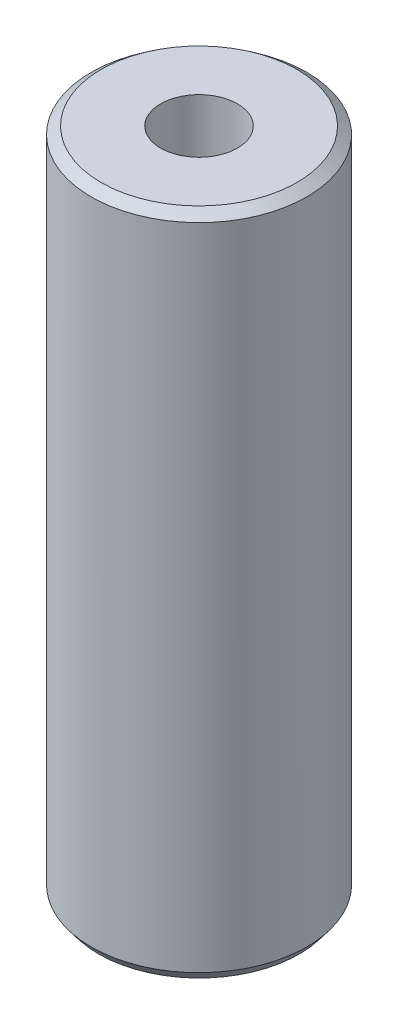
ISO-10303-21;
HEADER;
FILE_DESCRIPTION(('STEP AP214'),'2;1');
FILE_NAME('part.step','',(''),(''),'','','');
FILE_SCHEMA(('AUTOMOTIVE_DESIGN { 1 0 10303 214 1 1 1 1 }'));
ENDSEC;
DATA;
#1=APPLICATION_CONTEXT('core data for automotive mechanical design processes');
#2=APPLICATION_PROTOCOL_DEFINITION('international standard','automotive_design',2000,#1);
#3=PRODUCT_CONTEXT('',#1,'mechanical');
#4=PRODUCT('Part','Part','',(#3));
#5=PRODUCT_RELATED_PRODUCT_CATEGORY('part','',(#4));
#6=PRODUCT_DEFINITION_FORMATION('','',#4);
#7=PRODUCT_DEFINITION_CONTEXT('part definition',#1,'design');
#8=PRODUCT_DEFINITION('design','',#6,#7);
#9=PRODUCT_DEFINITION_SHAPE('','',#8);
#10=(LENGTH_UNIT() NAMED_UNIT(*) SI_UNIT(.MILLI.,.METRE.));
#11=(NAMED_UNIT(*) PLANE_ANGLE_UNIT() SI_UNIT($,.RADIAN.));
#12=(NAMED_UNIT(*) SI_UNIT($,.STERADIAN.) SOLID_ANGLE_UNIT());
#13=UNCERTAINTY_MEASURE_WITH_UNIT(LENGTH_MEASURE(1.E-05),#10,'distance_accuracy_value','');
#14=(GEOMETRIC_REPRESENTATION_CONTEXT(3) GLOBAL_UNCERTAINTY_ASSIGNED_CONTEXT((#13)) GLOBAL_UNIT_ASSIGNED_CONTEXT((#10,
#11,#12)) REPRESENTATION_CONTEXT('',''));
#15=CARTESIAN_POINT('',(0.,0.,0.));
#16=DIRECTION('',(0.,0.,1.));
#17=DIRECTION('',(1.,0.,0.));
#18=AXIS2_PLACEMENT_3D('',#15,#16,#17);
#19=CARTESIAN_POINT('',(0.,123.657801220755,0.));
#20=DIRECTION('',(0.,-1.,0.));
#21=DIRECTION('',(0.,0.,-1.));
#22=AXIS2_PLACEMENT_3D('',#19,#20,#21);
#23=CYLINDRICAL_SURFACE('',#22,20.);
#24=CARTESIAN_POINT('',(0.,122.269175722397,0.));
#25=DIRECTION('',(0.,1.,0.));
#26=DIRECTION('',(0.,0.,1.));
#27=AXIS2_PLACEMENT_3D('',#24,#25,#26);
#28=CIRCLE('',#27,20.);
#29=CARTESIAN_POINT('',(0.,122.269175722397,-20.));
#30=VERTEX_POINT('',#29);
#31=EDGE_CURVE('E50',#30,#30,#28,.F.);
#32=CARTESIAN_POINT('',(0.,1.83832751486898,0.));
#33=DIRECTION('',(0.,1.,0.));
#34=DIRECTION('',(0.,0.,1.));
#35=AXIS2_PLACEMENT_3D('',#32,#33,#34);
#36=CIRCLE('',#35,20.);
#37=CARTESIAN_POINT('',(0.,1.83832751486897,-20.));
#38=VERTEX_POINT('',#37);
#39=EDGE_CURVE('E51',#38,#38,#36,.T.);
#40=CARTESIAN_POINT('',(0.,122.269175722397,-20.));
#41=CARTESIAN_POINT('',(0.,121.014687720235,-20.));
#42=CARTESIAN_POINT('',(0.,119.760199718074,-20.));
#43=CARTESIAN_POINT('',(0.,117.25122371375,-20.));
#44=CARTESIAN_POINT('',(0.,115.996735711588,-20.));
#45=CARTESIAN_POINT('',(0.,113.487759707265,-20.));
#46=CARTESIAN_POINT('',(0.,112.233271705103,-20.));
#47=CARTESIAN_POINT('',(0.,109.72429570078,-20.));
#48=CARTESIAN_POINT('',(0.,108.469807698618,-20.));
#49=CARTESIAN_POINT('',(0.,105.960831694294,-20.));
#50=CARTESIAN_POINT('',(0.,104.706343692133,-20.));
#51=CARTESIAN_POINT('',(0.,102.197367687809,-20.));
#52=CARTESIAN_POINT('',(0.,100.942879685647,-20.));
#53=CARTESIAN_POINT('',(0.,98.4339036813239,-20.));
#54=CARTESIAN_POINT('',(0.,97.1794156791622,-20.));
#55=CARTESIAN_POINT('',(0.,94.6704396748387,-20.));
#56=CARTESIAN_POINT('',(0.,93.4159516726769,-20.));
#57=CARTESIAN_POINT('',(0.,90.9069756683534,-20.));
#58=CARTESIAN_POINT('',(0.,89.6524876661917,-20.));
#59=CARTESIAN_POINT('',(0.,87.1435116618682,-20.));
#60=CARTESIAN_POINT('',(0.,85.8890236597064,-20.));
#61=CARTESIAN_POINT('',(0.,83.3800476553829,-20.));
#62=CARTESIAN_POINT('',(0.,82.1255596532212,-20.));
#63=CARTESIAN_POINT('',(0.,79.6165836488976,-20.));
#64=CARTESIAN_POINT('',(0.,78.3620956467359,-20.));
#65=CARTESIAN_POINT('',(0.,75.8531196424124,-20.));
#66=CARTESIAN_POINT('',(0.,74.5986316402506,-20.));
#67=CARTESIAN_POINT('',(0.,72.0896556359271,-20.));
#68=CARTESIAN_POINT('',(0.,70.8351676337654,-20.));
#69=CARTESIAN_POINT('',(0.,68.3261916294419,-20.));
#70=CARTESIAN_POINT('',(0.,67.0717036272801,-20.));
#71=CARTESIAN_POINT('',(0.,64.5627276229566,-20.));
#72=CARTESIAN_POINT('',(0.,63.3082396207949,-20.));
#73=CARTESIAN_POINT('',(0.,60.7992636164714,-20.));
#74=CARTESIAN_POINT('',(0.,59.5447756143096,-20.));
#75=CARTESIAN_POINT('',(0.,57.0357996099861,-20.));
#76=CARTESIAN_POINT('',(0.,55.7813116078243,-20.));
#77=CARTESIAN_POINT('',(0.,53.2723356035008,-20.));
#78=CARTESIAN_POINT('',(0.,52.0178476013391,-20.));
#79=CARTESIAN_POINT('',(0.,49.5088715970156,-20.));
#80=CARTESIAN_POINT('',(0.,48.2543835948538,-20.));
#81=CARTESIAN_POINT('',(0.,45.7454075905303,-20.));
#82=CARTESIAN_POINT('',(0.,44.4909195883686,-20.));
#83=CARTESIAN_POINT('',(0.,41.9819435840451,-20.));
#84=CARTESIAN_POINT('',(0.,40.7274555818833,-20.));
#85=CARTESIAN_POINT('',(0.,38.2184795775598,-20.));
#86=CARTESIAN_POINT('',(0.,36.9639915753981,-20.));
#87=CARTESIAN_POINT('',(0.,34.4550155710745,-20.));
#88=CARTESIAN_POINT('',(0.,33.2005275689128,-20.));
#89=CARTESIAN_POINT('',(0.,30.6915515645893,-20.));
#90=CARTESIAN_POINT('',(0.,29.4370635624275,-20.));
#91=CARTESIAN_POINT('',(0.,26.928087558104,-20.));
#92=CARTESIAN_POINT('',(0.,25.6735995559423,-20.));
#93=CARTESIAN_POINT('',(0.,23.1646235516188,-20.));
#94=CARTESIAN_POINT('',(0.,21.910135549457,-20.));
#95=CARTESIAN_POINT('',(0.,19.4011595451335,-20.));
#96=CARTESIAN_POINT('',(0.,18.1466715429718,-20.));
#97=CARTESIAN_POINT('',(0.,15.6376955386482,-20.));
#98=CARTESIAN_POINT('',(0.,14.3832075364865,-20.));
#99=CARTESIAN_POINT('',(0.,11.874231532163,-20.));
#100=CARTESIAN_POINT('',(0.,10.6197435300012,-20.));
#101=CARTESIAN_POINT('',(0.,8.11076752567775,-20.));
#102=CARTESIAN_POINT('',(0.,6.856279523516,-20.));
#103=CARTESIAN_POINT('',(0.,4.34730351919249,-20.));
#104=CARTESIAN_POINT('',(0.,3.09281551703073,-20.));
#105=CARTESIAN_POINT('',(0.,1.83832751486897,-20.));
#106=B_SPLINE_CURVE_WITH_KNOTS('',3,(#40,#41,#42,#43,#44,#45,#46,#47,#48,#49,#50,#51,#52,#53,
#54,#55,#56,#57,#58,#59,#60,#61,#62,#63,#64,#65,#66,#67,#68,#69,#70,#71,#72,#73,#74,#75,#76,#77,
#78,#79,#80,#81,#82,#83,#84,#85,#86,#87,#88,#89,#90,#91,#92,#93,#94,#95,#96,#97,#98,#99,#100,
#101,#102,#103,#104,#105),.UNSPECIFIED.,.F.,.F.,(4,2,2,2,2,2,2,2,2,2,2,2,2,2,2,2,2,2,2,2,2,2,2,
2,2,2,2,2,2,2,2,2,4),(0.,3.76346400648526,7.52692801297052,11.2903920194558,15.053856025941,
18.8173200324263,22.5807840389116,26.3442480453968,30.1077120518821,33.8711760583673,
37.6346400648526,41.3981040713378,45.1615680778231,48.9250320843084,52.6884960907936,
56.4519600972789,60.2154241037641,63.9788881102494,67.7423521167347,71.5058161232199,
75.2692801297052,79.0327441361904,82.7962081426757,86.5596721491609,90.3231361556462,
94.0866001621315,97.8500641686167,101.613528175102,105.376992181587,109.140456188073,
112.903920194558,116.667384201043,120.430848207528),.UNSPECIFIED.);
#107=EDGE_CURVE('BSEAM39',#30,#38,#106,.T.);
#108=ORIENTED_EDGE('',*,*,#31,.T.);
#109=ORIENTED_EDGE('',*,*,#39,.T.);
#110=ORIENTED_EDGE('',*,*,#107,.T.);
#111=ORIENTED_EDGE('',*,*,#107,.F.);
#112=EDGE_LOOP('',(#108,#110,#109,#111));
#113=FACE_BOUND('',#112,.T.);
#114=ADVANCED_FACE('F39',(#113),#23,.T.);
#115=CARTESIAN_POINT('',(0.,123.657801220755,0.));
#116=DIRECTION('',(0.,1.,0.));
#117=DIRECTION('',(0.,0.,1.));
#118=AXIS2_PLACEMENT_3D('',#115,#116,#117);
#119=PLANE('',#118);
#120=CARTESIAN_POINT('',(0.,123.657801220755,0.));
#121=DIRECTION('',(0.,1.,0.));
#122=DIRECTION('',(0.,0.,1.));
#123=AXIS2_PLACEMENT_3D('',#120,#121,#122);
#124=CIRCLE('',#123,18.1616724851312);
#125=CARTESIAN_POINT('',(0.,123.657801220755,18.1616724851312));
#126=VERTEX_POINT('',#125);
#127=EDGE_CURVE('E54',#126,#126,#124,.T.);
#128=ORIENTED_EDGE('',*,*,#127,.T.);
#129=EDGE_LOOP('',(#128));
#130=FACE_BOUND('',#129,.T.);
#131=CARTESIAN_POINT('',(0.,123.657801220755,0.));
#132=DIRECTION('',(0.,1.,0.));
#133=DIRECTION('',(0.,0.,1.));
#134=AXIS2_PLACEMENT_3D('',#131,#132,#133);
#135=CIRCLE('',#134,7.1210716765023);
#136=CARTESIAN_POINT('',(0.,123.657801220755,-7.1210716765023));
#137=VERTEX_POINT('',#136);
#138=EDGE_CURVE('E58',#137,#137,#135,.T.);
#139=ORIENTED_EDGE('',*,*,#138,.F.);
#140=EDGE_LOOP('',(#139));
#141=FACE_BOUND('',#140,.T.);
#142=ADVANCED_FACE('F69',(#130,#141),#119,.T.);
#143=CARTESIAN_POINT('',(0.,0.,0.));
#144=DIRECTION('',(0.,1.,0.));
#145=DIRECTION('',(0.,0.,1.));
#146=AXIS2_PLACEMENT_3D('',#143,#144,#145);
#147=PLANE('',#146);
#148=CARTESIAN_POINT('',(0.,0.,0.));
#149=DIRECTION('',(0.,1.,0.));
#150=DIRECTION('',(0.,0.,1.));
#151=AXIS2_PLACEMENT_3D('',#148,#149,#150);
#152=CIRCLE('',#151,18.6113745016419);
#153=CARTESIAN_POINT('',(0.,0.,18.6113745016419));
#154=VERTEX_POINT('',#153);
#155=EDGE_CURVE('E10',#154,#154,#152,.F.);
#156=ORIENTED_EDGE('',*,*,#155,.T.);
#157=EDGE_LOOP('',(#156));
#158=FACE_BOUND('',#157,.T.);
#159=CARTESIAN_POINT('',(0.,0.,0.));
#160=DIRECTION('',(0.,1.,0.));
#161=DIRECTION('',(0.,0.,1.));
#162=AXIS2_PLACEMENT_3D('',#159,#160,#161);
#163=CIRCLE('',#162,7.1210716765023);
#164=CARTESIAN_POINT('',(0.,0.,-7.1210716765023));
#165=VERTEX_POINT('',#164);
#166=EDGE_CURVE('E63',#165,#165,#163,.T.);
#167=ORIENTED_EDGE('',*,*,#166,.T.);
#168=EDGE_LOOP('',(#167));
#169=FACE_BOUND('',#168,.T.);
#170=ADVANCED_FACE('F75',(#158,#169),#147,.F.);
#171=CARTESIAN_POINT('',(0.,123.657801220755,0.));
#172=DIRECTION('',(0.,-1.,0.));
#173=DIRECTION('',(0.,0.,-1.));
#174=AXIS2_PLACEMENT_3D('',#171,#172,#173);
#175=CYLINDRICAL_SURFACE('',#174,7.1210716765023);
#176=CARTESIAN_POINT('',(0.,123.657801220755,-7.1210716765023));
#177=CARTESIAN_POINT('',(0.,122.369699124706,-7.1210716765023));
#178=CARTESIAN_POINT('',(0.,121.081597028656,-7.1210716765023));
#179=CARTESIAN_POINT('',(0.,118.505392836557,-7.1210716765023));
#180=CARTESIAN_POINT('',(0.,117.217290740508,-7.1210716765023));
#181=CARTESIAN_POINT('',(0.,114.641086548408,-7.1210716765023));
#182=CARTESIAN_POINT('',(0.,113.352984452359,-7.1210716765023));
#183=CARTESIAN_POINT('',(0.,110.77678026026,-7.1210716765023));
#184=CARTESIAN_POINT('',(0.,109.48867816421,-7.1210716765023));
#185=CARTESIAN_POINT('',(0.,106.912473972111,-7.1210716765023));
#186=CARTESIAN_POINT('',(0.,105.624371876062,-7.1210716765023));
#187=CARTESIAN_POINT('',(0.,103.048167683963,-7.1210716765023));
#188=CARTESIAN_POINT('',(0.,101.760065587913,-7.1210716765023));
#189=CARTESIAN_POINT('',(0.,99.1838613958141,-7.1210716765023));
#190=CARTESIAN_POINT('',(0.,97.8957592997645,-7.1210716765023));
#191=CARTESIAN_POINT('',(0.,95.3195551076655,-7.1210716765023));
#192=CARTESIAN_POINT('',(0.,94.031453011616,-7.1210716765023));
#193=CARTESIAN_POINT('',(0.,91.4552488195169,-7.1210716765023));
#194=CARTESIAN_POINT('',(0.,90.1671467234673,-7.1210716765023));
#195=CARTESIAN_POINT('',(0.,87.5909425313683,-7.1210716765023));
#196=CARTESIAN_POINT('',(0.,86.3028404353187,-7.1210716765023));
#197=CARTESIAN_POINT('',(0.,83.7266362432197,-7.1210716765023));
#198=CARTESIAN_POINT('',(0.,82.4385341471701,-7.1210716765023));
#199=CARTESIAN_POINT('',(0.,79.8623299550711,-7.1210716765023));
#200=CARTESIAN_POINT('',(0.,78.5742278590215,-7.1210716765023));
#201=CARTESIAN_POINT('',(0.,75.9980236669225,-7.1210716765023));
#202=CARTESIAN_POINT('',(0.,74.709921570873,-7.1210716765023));
#203=CARTESIAN_POINT('',(0.,72.1337173787739,-7.1210716765023));
#204=CARTESIAN_POINT('',(0.,70.8456152827243,-7.1210716765023));
#205=CARTESIAN_POINT('',(0.,68.2694110906253,-7.1210716765023));
#206=CARTESIAN_POINT('',(0.,66.9813089945757,-7.1210716765023));
#207=CARTESIAN_POINT('',(0.,64.4051048024767,-7.1210716765023));
#208=CARTESIAN_POINT('',(0.,63.1170027064271,-7.1210716765023));
#209=CARTESIAN_POINT('',(0.,60.5407985143281,-7.1210716765023));
#210=CARTESIAN_POINT('',(0.,59.2526964182785,-7.1210716765023));
#211=CARTESIAN_POINT('',(0.,56.6764922261795,-7.1210716765023));
#212=CARTESIAN_POINT('',(0.,55.3883901301299,-7.1210716765023));
#213=CARTESIAN_POINT('',(0.,52.8121859380309,-7.1210716765023));
#214=CARTESIAN_POINT('',(0.,51.5240838419813,-7.1210716765023));
#215=CARTESIAN_POINT('',(0.,48.9478796498823,-7.1210716765023));
#216=CARTESIAN_POINT('',(0.,47.6597775538327,-7.1210716765023));
#217=CARTESIAN_POINT('',(0.,45.0835733617337,-7.1210716765023));
#218=CARTESIAN_POINT('',(0.,43.7954712656841,-7.1210716765023));
#219=CARTESIAN_POINT('',(0.,41.2192670735851,-7.1210716765023));
#220=CARTESIAN_POINT('',(0.,39.9311649775355,-7.1210716765023));
#221=CARTESIAN_POINT('',(0.,37.3549607854365,-7.1210716765023));
#222=CARTESIAN_POINT('',(0.,36.0668586893869,-7.1210716765023));
#223=CARTESIAN_POINT('',(0.,33.4906544972879,-7.1210716765023));
#224=CARTESIAN_POINT('',(0.,32.2025524012383,-7.1210716765023));
#225=CARTESIAN_POINT('',(0.,29.6263482091393,-7.1210716765023));
#226=CARTESIAN_POINT('',(0.,28.3382461130897,-7.1210716765023));
#227=CARTESIAN_POINT('',(0.,25.7620419209907,-7.1210716765023));
#228=CARTESIAN_POINT('',(0.,24.4739398249411,-7.1210716765023));
#229=CARTESIAN_POINT('',(0.,21.8977356328421,-7.1210716765023));
#230=CARTESIAN_POINT('',(0.,20.6096335367925,-7.1210716765023));
#231=CARTESIAN_POINT('',(0.,18.0334293446935,-7.1210716765023));
#232=CARTESIAN_POINT('',(0.,16.7453272486439,-7.1210716765023));
#233=CARTESIAN_POINT('',(0.,14.1691230565449,-7.1210716765023));
#234=CARTESIAN_POINT('',(0.,12.8810209604953,-7.1210716765023));
#235=CARTESIAN_POINT('',(0.,10.3048167683963,-7.1210716765023));
#236=CARTESIAN_POINT('',(0.,9.01671467234672,-7.1210716765023));
#237=CARTESIAN_POINT('',(0.,6.44051048024765,-7.1210716765023));
#238=CARTESIAN_POINT('',(0.,5.15240838419812,-7.1210716765023));
#239=CARTESIAN_POINT('',(0.,2.57620419209905,-7.1210716765023));
#240=CARTESIAN_POINT('',(0.,1.28810209604952,-7.1210716765023));
#241=CARTESIAN_POINT('',(0.,0.,-7.1210716765023));
#242=B_SPLINE_CURVE_WITH_KNOTS('',3,(#176,#177,#178,#179,#180,#181,#182,#183,#184,#185,#186,
#187,#188,#189,#190,#191,#192,#193,#194,#195,#196,#197,#198,#199,#200,#201,#202,#203,#204,#205,
#206,#207,#208,#209,#210,#211,#212,#213,#214,#215,#216,#217,#218,#219,#220,#221,#222,#223,#224,
#225,#226,#227,#228,#229,#230,#231,#232,#233,#234,#235,#236,#237,#238,#239,#240,#241),
.UNSPECIFIED.,.F.,.F.,(4,2,2,2,2,2,2,2,2,2,2,2,2,2,2,2,2,2,2,2,2,2,2,2,2,2,2,2,2,2,2,2,4),(0.,
3.8643062881486,7.7286125762972,11.5929188644458,15.4572251525944,19.321531440743,
23.1858377288916,27.0501440170402,30.9144503051888,34.7787565933374,38.643062881486,
42.5073691696346,46.3716754577832,50.2359817459318,54.1002880340804,57.964594322229,
61.8289006103776,65.6932068985262,69.5575131866748,73.4218194748234,77.286125762972,
81.1504320511206,85.0147383392692,88.8790446274178,92.7433509155664,96.607657203715,
100.471963491864,104.336269780012,108.200576068161,112.064882356309,115.929188644458,
119.793494932607,123.657801220755),.UNSPECIFIED.);
#243=EDGE_CURVE('BSEAM70',#137,#165,#242,.T.);
#244=ORIENTED_EDGE('',*,*,#138,.T.);
#245=ORIENTED_EDGE('',*,*,#166,.F.);
#246=ORIENTED_EDGE('',*,*,#243,.T.);
#247=ORIENTED_EDGE('',*,*,#243,.F.);
#248=EDGE_LOOP('',(#244,#246,#245,#247));
#249=FACE_BOUND('',#248,.T.);
#250=ADVANCED_FACE('F70',(#249),#175,.F.);
#251=CARTESIAN_POINT('',(0.,123.657801220755,0.));
#252=DIRECTION('',(0.,-1.,0.));
#253=DIRECTION('',(0.,0.,-1.));
#254=AXIS2_PLACEMENT_3D('',#251,#252,#253);
#255=CONICAL_SURFACE('',#254,18.1616724851312,0.923864481500298);
#256=ORIENTED_EDGE('',*,*,#31,.F.);
#257=EDGE_LOOP('',(#256));
#258=FACE_BOUND('',#257,.T.);
#259=ORIENTED_EDGE('',*,*,#127,.F.);
#260=EDGE_LOOP('',(#259));
#261=FACE_BOUND('',#260,.T.);
#262=ADVANCED_FACE('F81',(#258,#261),#255,.T.);
#263=CARTESIAN_POINT('',(0.,1.83832751486898,0.));
#264=DIRECTION('',(0.,1.,0.));
#265=DIRECTION('',(0.,0.,1.));
#266=AXIS2_PLACEMENT_3D('',#263,#264,#265);
#267=CONICAL_SURFACE('',#266,20.,0.646931845294602);
#268=ORIENTED_EDGE('',*,*,#155,.F.);
#269=EDGE_LOOP('',(#268));
#270=FACE_BOUND('',#269,.T.);
#271=ORIENTED_EDGE('',*,*,#39,.F.);
#272=EDGE_LOOP('',(#271));
#273=FACE_BOUND('',#272,.T.);
#274=ADVANCED_FACE('F45',(#270,#273),#267,.T.);
#275=CLOSED_SHELL('',(#114,#142,#170,#250,#262,#274));
#276=MANIFOLD_SOLID_BREP('B2',#275);
#277=ADVANCED_BREP_SHAPE_REPRESENTATION('',(#18,#276),#14);
#278=SHAPE_DEFINITION_REPRESENTATION(#9,#277);
ENDSEC;
END-ISO-10303-21;
